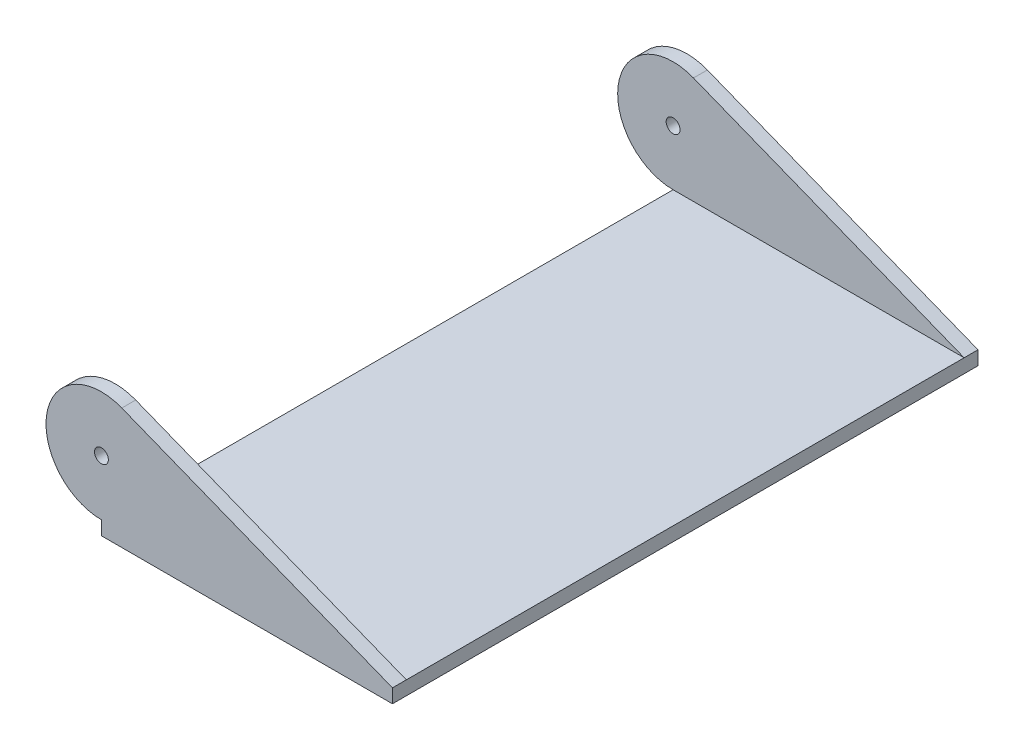
ISO-10303-21;
HEADER;
FILE_DESCRIPTION(('STEP AP214'),'2;1');
FILE_NAME('part.step','',(''),(''),'','','');
FILE_SCHEMA(('AUTOMOTIVE_DESIGN { 1 0 10303 214 1 1 1 1 }'));
ENDSEC;
DATA;
#1=APPLICATION_CONTEXT('core data for automotive mechanical design processes');
#2=APPLICATION_PROTOCOL_DEFINITION('international standard','automotive_design',2000,#1);
#3=PRODUCT_CONTEXT('',#1,'mechanical');
#4=PRODUCT('Part','Part','',(#3));
#5=PRODUCT_RELATED_PRODUCT_CATEGORY('part','',(#4));
#6=PRODUCT_DEFINITION_FORMATION('','',#4);
#7=PRODUCT_DEFINITION_CONTEXT('part definition',#1,'design');
#8=PRODUCT_DEFINITION('design','',#6,#7);
#9=PRODUCT_DEFINITION_SHAPE('','',#8);
#10=(LENGTH_UNIT() NAMED_UNIT(*) SI_UNIT(.MILLI.,.METRE.));
#11=(NAMED_UNIT(*) PLANE_ANGLE_UNIT() SI_UNIT($,.RADIAN.));
#12=(NAMED_UNIT(*) SI_UNIT($,.STERADIAN.) SOLID_ANGLE_UNIT());
#13=UNCERTAINTY_MEASURE_WITH_UNIT(LENGTH_MEASURE(1.E-05),#10,'distance_accuracy_value','');
#14=(GEOMETRIC_REPRESENTATION_CONTEXT(3) GLOBAL_UNCERTAINTY_ASSIGNED_CONTEXT((#13)) GLOBAL_UNIT_ASSIGNED_CONTEXT((#10,
#11,#12)) REPRESENTATION_CONTEXT('',''));
#15=CARTESIAN_POINT('',(0.,0.,0.));
#16=DIRECTION('',(0.,0.,1.));
#17=DIRECTION('',(1.,0.,0.));
#18=AXIS2_PLACEMENT_3D('',#15,#16,#17);
#19=CARTESIAN_POINT('',(1.63802124980249,4.14380375694082,-126.003723502117));
#20=DIRECTION('',(0.367614879649891,0.929978118161926,0.));
#21=DIRECTION('',(-0.929978118161926,0.367614879649891,0.));
#22=AXIS2_PLACEMENT_3D('',#19,#20,#21);
#23=PLANE('',#22);
#24=DIRECTION('',(0.929978118161926,-0.367614879649891,0.));
#25=VECTOR('',#24,1.);
#26=CARTESIAN_POINT('',(1.63802124980248,4.14380375694082,-18.8493634259259));
#27=LINE('',#26,#25);
#28=CARTESIAN_POINT('',(-22.8982844031121,13.8428610503282,-18.8493634259259));
#29=VERTEX_POINT('',#28);
#30=CARTESIAN_POINT('',(8.10486111111111,1.5875,-18.8493634259259));
#31=VERTEX_POINT('',#30);
#32=EDGE_CURVE('E134',#29,#31,#27,.T.);
#33=ORIENTED_EDGE('',*,*,#32,.F.);
#34=DIRECTION('',(0.,0.,1.));
#35=VECTOR('',#34,1.);
#36=CARTESIAN_POINT('',(-22.8982844031121,13.8428610503282,-126.003723502117));
#37=LINE('',#36,#35);
#38=CARTESIAN_POINT('',(-22.8982844031121,13.8428610503282,-17.2618634259259));
#39=VERTEX_POINT('',#38);
#40=EDGE_CURVE('E152',#29,#39,#37,.T.);
#41=ORIENTED_EDGE('',*,*,#40,.T.);
#42=DIRECTION('',(-0.929978118161926,0.367614879649891,0.));
#43=VECTOR('',#42,1.);
#44=CARTESIAN_POINT('',(1.63802124980249,4.14380375694082,-17.2618634259259));
#45=LINE('',#44,#43);
#46=CARTESIAN_POINT('',(8.10486111111111,1.5875,-17.2618634259259));
#47=VERTEX_POINT('',#46);
#48=EDGE_CURVE('E141',#47,#39,#45,.T.);
#49=ORIENTED_EDGE('',*,*,#48,.F.);
#50=DIRECTION('',(0.,0.,1.));
#51=VECTOR('',#50,1.);
#52=CARTESIAN_POINT('',(8.10486111111111,1.5875,-84.3337384259259));
#53=LINE('',#52,#51);
#54=EDGE_CURVE('E88',#31,#47,#53,.T.);
#55=ORIENTED_EDGE('',*,*,#54,.F.);
#56=EDGE_LOOP('',(#33,#41,#49,#55));
#57=FACE_BOUND('',#56,.T.);
#58=ADVANCED_FACE('F34',(#57),#23,.T.);
#59=CARTESIAN_POINT('',(-25.2326388888889,7.9375,-126.003723502117));
#60=DIRECTION('',(0.,0.,1.));
#61=DIRECTION('',(1.,0.,0.));
#62=AXIS2_PLACEMENT_3D('',#59,#60,#61);
#63=CYLINDRICAL_SURFACE('',#62,6.35);
#64=CARTESIAN_POINT('',(-25.2326388888889,7.9375,-18.8493634259259));
#65=DIRECTION('',(0.,0.,1.));
#66=DIRECTION('',(0.,-1.,0.));
#67=AXIS2_PLACEMENT_3D('',#64,#65,#66);
#68=CIRCLE('',#67,6.35);
#69=CARTESIAN_POINT('',(-25.2326388888889,1.5875,-18.8493634259259));
#70=VERTEX_POINT('',#69);
#71=EDGE_CURVE('E131',#70,#29,#68,.F.);
#72=ORIENTED_EDGE('',*,*,#71,.F.);
#73=DIRECTION('',(0.,0.,1.));
#74=VECTOR('',#73,1.);
#75=CARTESIAN_POINT('',(-25.2326388888889,1.5875,-84.3337384259259));
#76=LINE('',#75,#74);
#77=CARTESIAN_POINT('',(-25.2326388888889,1.5875,-17.2618634259259));
#78=VERTEX_POINT('',#77);
#79=EDGE_CURVE('E156',#70,#78,#76,.T.);
#80=ORIENTED_EDGE('',*,*,#79,.T.);
#81=CARTESIAN_POINT('',(-25.2326388888889,7.9375,-17.2618634259259));
#82=DIRECTION('',(0.,0.,1.));
#83=DIRECTION('',(1.,0.,0.));
#84=AXIS2_PLACEMENT_3D('',#81,#82,#83);
#85=CIRCLE('',#84,6.35);
#86=EDGE_CURVE('E100',#39,#78,#85,.T.);
#87=ORIENTED_EDGE('',*,*,#86,.F.);
#88=ORIENTED_EDGE('',*,*,#40,.F.);
#89=EDGE_LOOP('',(#72,#80,#87,#88));
#90=FACE_BOUND('',#89,.T.);
#91=ADVANCED_FACE('F199',(#90),#63,.T.);
#92=CARTESIAN_POINT('',(-25.2326388888889,7.9375,-126.003723502117));
#93=DIRECTION('',(0.,0.,1.));
#94=DIRECTION('',(1.,0.,0.));
#95=AXIS2_PLACEMENT_3D('',#92,#93,#94);
#96=CYLINDRICAL_SURFACE('',#95,0.793749999999999);
#97=CARTESIAN_POINT('',(-25.2326388888889,7.9375,-18.8493634259259));
#98=DIRECTION('',(0.,0.,1.));
#99=DIRECTION('',(0.,-1.,0.));
#100=AXIS2_PLACEMENT_3D('',#97,#98,#99);
#101=CIRCLE('',#100,0.793749999999999);
#102=CARTESIAN_POINT('',(-25.2326388888889,7.14375,-18.8493634259259));
#103=VERTEX_POINT('',#102);
#104=EDGE_CURVE('E38',#103,#103,#101,.F.);
#105=ORIENTED_EDGE('',*,*,#104,.T.);
#106=EDGE_LOOP('',(#105));
#107=FACE_BOUND('',#106,.T.);
#108=CARTESIAN_POINT('',(-25.2326388888889,7.9375,-17.2618634259259));
#109=DIRECTION('',(0.,0.,1.));
#110=DIRECTION('',(1.,0.,0.));
#111=AXIS2_PLACEMENT_3D('',#108,#109,#110);
#112=CIRCLE('',#111,0.793749999999999);
#113=CARTESIAN_POINT('',(-24.4388888888889,7.9375,-17.2618634259259));
#114=VERTEX_POINT('',#113);
#115=EDGE_CURVE('E138',#114,#114,#112,.T.);
#116=ORIENTED_EDGE('',*,*,#115,.T.);
#117=EDGE_LOOP('',(#116));
#118=FACE_BOUND('',#117,.T.);
#119=ADVANCED_FACE('F218',(#107,#118),#96,.F.);
#120=CARTESIAN_POINT('',(-25.2326388888889,1.5875,-84.3337384259259));
#121=DIRECTION('',(0.,0.,-1.));
#122=DIRECTION('',(-1.,0.,0.));
#123=AXIS2_PLACEMENT_3D('',#120,#121,#122);
#124=PLANE('',#123);
#125=DIRECTION('',(1.,0.,0.));
#126=VECTOR('',#125,1.);
#127=CARTESIAN_POINT('',(-25.2326388888889,0.,-84.3337384259259));
#128=LINE('',#127,#126);
#129=CARTESIAN_POINT('',(-25.2326388888889,0.,-84.3337384259259));
#130=VERTEX_POINT('',#129);
#131=CARTESIAN_POINT('',(8.10486111111111,0.,-84.3337384259259));
#132=VERTEX_POINT('',#131);
#133=EDGE_CURVE('E107',#130,#132,#128,.T.);
#134=ORIENTED_EDGE('',*,*,#133,.F.);
#135=DIRECTION('',(0.,-1.,0.));
#136=VECTOR('',#135,1.);
#137=CARTESIAN_POINT('',(-25.2326388888889,1.5875,-84.3337384259259));
#138=LINE('',#137,#136);
#139=CARTESIAN_POINT('',(-25.2326388888889,1.5875,-84.3337384259259));
#140=VERTEX_POINT('',#139);
#141=EDGE_CURVE('E11',#140,#130,#138,.T.);
#142=ORIENTED_EDGE('',*,*,#141,.F.);
#143=CARTESIAN_POINT('',(-25.2326388888889,7.9375,-84.3337384259259));
#144=DIRECTION('',(0.,0.,-1.));
#145=DIRECTION('',(-1.,0.,0.));
#146=AXIS2_PLACEMENT_3D('',#143,#144,#145);
#147=CIRCLE('',#146,6.35);
#148=CARTESIAN_POINT('',(-22.8982844031121,13.8428610503282,-84.3337384259259));
#149=VERTEX_POINT('',#148);
#150=EDGE_CURVE('E142',#149,#140,#147,.F.);
#151=ORIENTED_EDGE('',*,*,#150,.F.);
#152=DIRECTION('',(-0.929978118161926,0.367614879649891,0.));
#153=VECTOR('',#152,1.);
#154=CARTESIAN_POINT('',(1.63802124980249,4.14380375694082,-84.3337384259259));
#155=LINE('',#154,#153);
#156=CARTESIAN_POINT('',(8.10486111111111,1.5875,-84.3337384259259));
#157=VERTEX_POINT('',#156);
#158=EDGE_CURVE('E137',#157,#149,#155,.T.);
#159=ORIENTED_EDGE('',*,*,#158,.F.);
#160=DIRECTION('',(0.,-1.,0.));
#161=VECTOR('',#160,1.);
#162=CARTESIAN_POINT('',(8.10486111111111,1.5875,-84.3337384259259));
#163=LINE('',#162,#161);
#164=EDGE_CURVE('E112',#157,#132,#163,.T.);
#165=ORIENTED_EDGE('',*,*,#164,.T.);
#166=EDGE_LOOP('',(#134,#142,#151,#159,#165));
#167=FACE_BOUND('',#166,.T.);
#168=CARTESIAN_POINT('',(-25.2326388888889,7.9375,-84.3337384259259));
#169=DIRECTION('',(0.,0.,-1.));
#170=DIRECTION('',(-1.,0.,0.));
#171=AXIS2_PLACEMENT_3D('',#168,#169,#170);
#172=CIRCLE('',#171,0.793749999999999);
#173=CARTESIAN_POINT('',(-26.0263888888889,7.9375,-84.3337384259259));
#174=VERTEX_POINT('',#173);
#175=EDGE_CURVE('E144',#174,#174,#172,.F.);
#176=ORIENTED_EDGE('',*,*,#175,.T.);
#177=EDGE_LOOP('',(#176));
#178=FACE_BOUND('',#177,.T.);
#179=ADVANCED_FACE('F36',(#167,#178),#124,.T.);
#180=CARTESIAN_POINT('',(-25.2326388888889,1.5875,-84.3337384259259));
#181=DIRECTION('',(1.,0.,0.));
#182=DIRECTION('',(0.,0.,-1.));
#183=AXIS2_PLACEMENT_3D('',#180,#181,#182);
#184=PLANE('',#183);
#185=DIRECTION('',(0.,0.,1.));
#186=VECTOR('',#185,1.);
#187=CARTESIAN_POINT('',(-25.2326388888889,0.,-84.3337384259259));
#188=LINE('',#187,#186);
#189=CARTESIAN_POINT('',(-25.2326388888889,0.,-17.2618634259259));
#190=VERTEX_POINT('',#189);
#191=EDGE_CURVE('E77',#130,#190,#188,.T.);
#192=ORIENTED_EDGE('',*,*,#191,.T.);
#193=DIRECTION('',(0.,-1.,0.));
#194=VECTOR('',#193,1.);
#195=CARTESIAN_POINT('',(-25.2326388888889,1.5875,-17.2618634259259));
#196=LINE('',#195,#194);
#197=EDGE_CURVE('E43',#78,#190,#196,.T.);
#198=ORIENTED_EDGE('',*,*,#197,.F.);
#199=ORIENTED_EDGE('',*,*,#79,.F.);
#200=CARTESIAN_POINT('',(-25.2326388888889,1.5875,-82.7462384259259));
#201=VERTEX_POINT('',#200);
#202=EDGE_CURVE('E158',#201,#70,#76,.T.);
#203=ORIENTED_EDGE('',*,*,#202,.F.);
#204=EDGE_CURVE('E113',#140,#201,#76,.T.);
#205=ORIENTED_EDGE('',*,*,#204,.F.);
#206=ORIENTED_EDGE('',*,*,#141,.T.);
#207=EDGE_LOOP('',(#192,#198,#199,#203,#205,#206));
#208=FACE_BOUND('',#207,.T.);
#209=ADVANCED_FACE('F79',(#208),#184,.F.);
#210=CARTESIAN_POINT('',(-25.2326388888889,1.5875,-17.2618634259259));
#211=DIRECTION('',(0.,0.,-1.));
#212=DIRECTION('',(-1.,0.,0.));
#213=AXIS2_PLACEMENT_3D('',#210,#211,#212);
#214=PLANE('',#213);
#215=DIRECTION('',(1.,0.,0.));
#216=VECTOR('',#215,1.);
#217=CARTESIAN_POINT('',(-25.2326388888889,0.,-17.2618634259259));
#218=LINE('',#217,#216);
#219=CARTESIAN_POINT('',(8.10486111111111,0.,-17.2618634259259));
#220=VERTEX_POINT('',#219);
#221=EDGE_CURVE('E89',#190,#220,#218,.T.);
#222=ORIENTED_EDGE('',*,*,#221,.T.);
#223=DIRECTION('',(0.,-1.,0.));
#224=VECTOR('',#223,1.);
#225=CARTESIAN_POINT('',(8.10486111111111,1.5875,-17.2618634259259));
#226=LINE('',#225,#224);
#227=EDGE_CURVE('E101',#47,#220,#226,.T.);
#228=ORIENTED_EDGE('',*,*,#227,.F.);
#229=ORIENTED_EDGE('',*,*,#48,.T.);
#230=ORIENTED_EDGE('',*,*,#86,.T.);
#231=ORIENTED_EDGE('',*,*,#197,.T.);
#232=EDGE_LOOP('',(#222,#228,#229,#230,#231));
#233=FACE_BOUND('',#232,.T.);
#234=ORIENTED_EDGE('',*,*,#115,.F.);
#235=EDGE_LOOP('',(#234));
#236=FACE_BOUND('',#235,.T.);
#237=ADVANCED_FACE('F94',(#233,#236),#214,.F.);
#238=CARTESIAN_POINT('',(8.10486111111111,1.5875,-84.3337384259259));
#239=DIRECTION('',(1.,0.,0.));
#240=DIRECTION('',(0.,0.,-1.));
#241=AXIS2_PLACEMENT_3D('',#238,#239,#240);
#242=PLANE('',#241);
#243=DIRECTION('',(0.,0.,1.));
#244=VECTOR('',#243,1.);
#245=CARTESIAN_POINT('',(8.10486111111111,0.,-84.3337384259259));
#246=LINE('',#245,#244);
#247=EDGE_CURVE('E105',#132,#220,#246,.T.);
#248=ORIENTED_EDGE('',*,*,#247,.F.);
#249=ORIENTED_EDGE('',*,*,#164,.F.);
#250=CARTESIAN_POINT('',(8.10486111111111,1.5875,-82.7462384259259));
#251=VERTEX_POINT('',#250);
#252=EDGE_CURVE('E60',#157,#251,#53,.T.);
#253=ORIENTED_EDGE('',*,*,#252,.T.);
#254=DIRECTION('',(0.,0.,-1.));
#255=VECTOR('',#254,1.);
#256=CARTESIAN_POINT('',(8.10486111111111,1.5875,-18.8493634259259));
#257=LINE('',#256,#255);
#258=EDGE_CURVE('E126',#31,#251,#257,.T.);
#259=ORIENTED_EDGE('',*,*,#258,.F.);
#260=ORIENTED_EDGE('',*,*,#54,.T.);
#261=ORIENTED_EDGE('',*,*,#227,.T.);
#262=EDGE_LOOP('',(#248,#249,#253,#259,#260,#261));
#263=FACE_BOUND('',#262,.T.);
#264=ADVANCED_FACE('F165',(#263),#242,.T.);
#265=CARTESIAN_POINT('',(0.,0.,0.));
#266=DIRECTION('',(0.,-1.,0.));
#267=DIRECTION('',(0.,0.,-1.));
#268=AXIS2_PLACEMENT_3D('',#265,#266,#267);
#269=PLANE('',#268);
#270=ORIENTED_EDGE('',*,*,#133,.T.);
#271=ORIENTED_EDGE('',*,*,#247,.T.);
#272=ORIENTED_EDGE('',*,*,#221,.F.);
#273=ORIENTED_EDGE('',*,*,#191,.F.);
#274=EDGE_LOOP('',(#270,#271,#272,#273));
#275=FACE_BOUND('',#274,.T.);
#276=ADVANCED_FACE('F103',(#275),#269,.T.);
#277=DIRECTION('',(-0.929978118161926,0.367614879649891,0.));
#278=VECTOR('',#277,1.);
#279=CARTESIAN_POINT('',(1.63802124980249,4.14380375694082,-82.7462384259259));
#280=LINE('',#279,#278);
#281=CARTESIAN_POINT('',(-22.8982844031121,13.8428610503282,-82.7462384259259));
#282=VERTEX_POINT('',#281);
#283=EDGE_CURVE('E119',#251,#282,#280,.T.);
#284=ORIENTED_EDGE('',*,*,#283,.F.);
#285=ORIENTED_EDGE('',*,*,#252,.F.);
#286=ORIENTED_EDGE('',*,*,#158,.T.);
#287=EDGE_CURVE('E150',#149,#282,#37,.T.);
#288=ORIENTED_EDGE('',*,*,#287,.T.);
#289=EDGE_LOOP('',(#284,#285,#286,#288));
#290=FACE_BOUND('',#289,.T.);
#291=ADVANCED_FACE('F203',(#290),#23,.T.);
#292=ORIENTED_EDGE('',*,*,#204,.T.);
#293=CARTESIAN_POINT('',(-25.2326388888889,7.9375,-82.7462384259259));
#294=DIRECTION('',(0.,0.,-1.));
#295=DIRECTION('',(-1.,0.,0.));
#296=AXIS2_PLACEMENT_3D('',#293,#294,#295);
#297=CIRCLE('',#296,6.35);
#298=EDGE_CURVE('E51',#282,#201,#297,.F.);
#299=ORIENTED_EDGE('',*,*,#298,.F.);
#300=ORIENTED_EDGE('',*,*,#287,.F.);
#301=ORIENTED_EDGE('',*,*,#150,.T.);
#302=EDGE_LOOP('',(#292,#299,#300,#301));
#303=FACE_BOUND('',#302,.T.);
#304=ADVANCED_FACE('F201',(#303),#63,.T.);
#305=CARTESIAN_POINT('',(-25.2326388888889,7.9375,-82.7462384259259));
#306=DIRECTION('',(0.,0.,-1.));
#307=DIRECTION('',(-1.,0.,0.));
#308=AXIS2_PLACEMENT_3D('',#305,#306,#307);
#309=CIRCLE('',#308,0.793749999999999);
#310=CARTESIAN_POINT('',(-26.0263888888889,7.9375,-82.7462384259259));
#311=VERTEX_POINT('',#310);
#312=EDGE_CURVE('E114',#311,#311,#309,.F.);
#313=ORIENTED_EDGE('',*,*,#312,.T.);
#314=EDGE_LOOP('',(#313));
#315=FACE_BOUND('',#314,.T.);
#316=ORIENTED_EDGE('',*,*,#175,.F.);
#317=EDGE_LOOP('',(#316));
#318=FACE_BOUND('',#317,.T.);
#319=ADVANCED_FACE('F226',(#315,#318),#96,.F.);
#320=CARTESIAN_POINT('',(-31.5826388888889,1.5875,-18.8493634259259));
#321=DIRECTION('',(0.,-1.,0.));
#322=DIRECTION('',(0.,0.,-1.));
#323=AXIS2_PLACEMENT_3D('',#320,#321,#322);
#324=PLANE('',#323);
#325=DIRECTION('',(1.,0.,0.));
#326=VECTOR('',#325,1.);
#327=CARTESIAN_POINT('',(-31.5826388888889,1.5875,-18.8493634259259));
#328=LINE('',#327,#326);
#329=EDGE_CURVE('E121',#70,#31,#328,.T.);
#330=ORIENTED_EDGE('',*,*,#329,.T.);
#331=ORIENTED_EDGE('',*,*,#258,.T.);
#332=DIRECTION('',(1.,0.,0.));
#333=VECTOR('',#332,1.);
#334=CARTESIAN_POINT('',(-31.5826388888889,1.5875,-82.7462384259259));
#335=LINE('',#334,#333);
#336=EDGE_CURVE('E116',#201,#251,#335,.T.);
#337=ORIENTED_EDGE('',*,*,#336,.F.);
#338=ORIENTED_EDGE('',*,*,#202,.T.);
#339=EDGE_LOOP('',(#330,#331,#337,#338));
#340=FACE_BOUND('',#339,.T.);
#341=ADVANCED_FACE('F196',(#340),#324,.F.);
#342=CARTESIAN_POINT('',(-31.5826388888889,1.5875,-18.8493634259259));
#343=DIRECTION('',(0.,0.,1.));
#344=DIRECTION('',(0.,-1.,0.));
#345=AXIS2_PLACEMENT_3D('',#342,#343,#344);
#346=PLANE('',#345);
#347=ORIENTED_EDGE('',*,*,#32,.T.);
#348=ORIENTED_EDGE('',*,*,#329,.F.);
#349=ORIENTED_EDGE('',*,*,#71,.T.);
#350=EDGE_LOOP('',(#347,#348,#349));
#351=FACE_BOUND('',#350,.T.);
#352=ORIENTED_EDGE('',*,*,#104,.F.);
#353=EDGE_LOOP('',(#352));
#354=FACE_BOUND('',#353,.T.);
#355=ADVANCED_FACE('F190',(#351,#354),#346,.F.);
#356=CARTESIAN_POINT('',(-31.5826388888889,1.5875,-82.7462384259259));
#357=DIRECTION('',(0.,0.,-1.));
#358=DIRECTION('',(-1.,0.,0.));
#359=AXIS2_PLACEMENT_3D('',#356,#357,#358);
#360=PLANE('',#359);
#361=ORIENTED_EDGE('',*,*,#283,.T.);
#362=ORIENTED_EDGE('',*,*,#298,.T.);
#363=ORIENTED_EDGE('',*,*,#336,.T.);
#364=EDGE_LOOP('',(#361,#362,#363));
#365=FACE_BOUND('',#364,.T.);
#366=ORIENTED_EDGE('',*,*,#312,.F.);
#367=EDGE_LOOP('',(#366));
#368=FACE_BOUND('',#367,.T.);
#369=ADVANCED_FACE('F204',(#365,#368),#360,.F.);
#370=CLOSED_SHELL('',(#58,#91,#119,#179,#209,#237,#264,#276,#291,#304,#319,#341,#355,#369));
#371=MANIFOLD_SOLID_BREP('B2',#370);
#372=ADVANCED_BREP_SHAPE_REPRESENTATION('',(#18,#371),#14);
#373=SHAPE_DEFINITION_REPRESENTATION(#9,#372);
ENDSEC;
END-ISO-10303-21;
